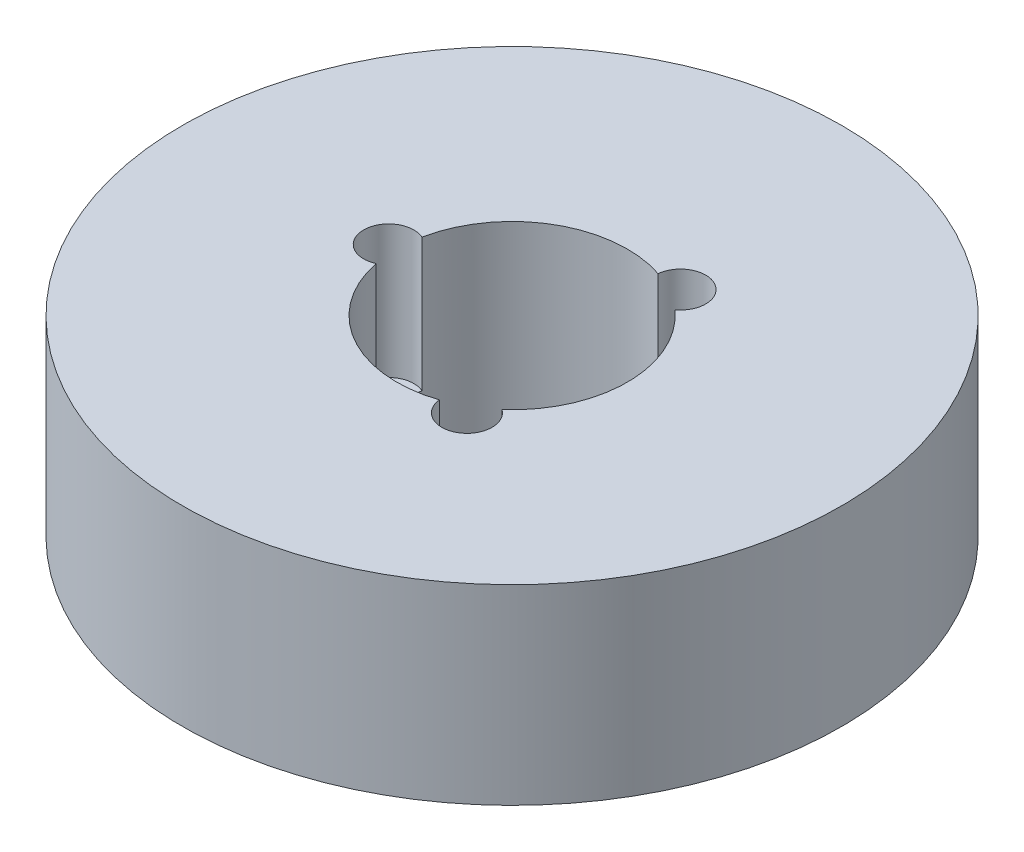
ISO-10303-21;
HEADER;
FILE_DESCRIPTION(('STEP AP214'),'2;1');
FILE_NAME('part.step','',(''),(''),'','','');
FILE_SCHEMA(('AUTOMOTIVE_DESIGN { 1 0 10303 214 1 1 1 1 }'));
ENDSEC;
DATA;
#1=APPLICATION_CONTEXT('core data for automotive mechanical design processes');
#2=APPLICATION_PROTOCOL_DEFINITION('international standard','automotive_design',2000,#1);
#3=PRODUCT_CONTEXT('',#1,'mechanical');
#4=PRODUCT('Part','Part','',(#3));
#5=PRODUCT_RELATED_PRODUCT_CATEGORY('part','',(#4));
#6=PRODUCT_DEFINITION_FORMATION('','',#4);
#7=PRODUCT_DEFINITION_CONTEXT('part definition',#1,'design');
#8=PRODUCT_DEFINITION('design','',#6,#7);
#9=PRODUCT_DEFINITION_SHAPE('','',#8);
#10=(LENGTH_UNIT() NAMED_UNIT(*) SI_UNIT(.MILLI.,.METRE.));
#11=(NAMED_UNIT(*) PLANE_ANGLE_UNIT() SI_UNIT($,.RADIAN.));
#12=(NAMED_UNIT(*) SI_UNIT($,.STERADIAN.) SOLID_ANGLE_UNIT());
#13=UNCERTAINTY_MEASURE_WITH_UNIT(LENGTH_MEASURE(1.E-05),#10,'distance_accuracy_value','');
#14=(GEOMETRIC_REPRESENTATION_CONTEXT(3) GLOBAL_UNCERTAINTY_ASSIGNED_CONTEXT((#13)) GLOBAL_UNIT_ASSIGNED_CONTEXT((#10,
#11,#12)) REPRESENTATION_CONTEXT('',''));
#15=CARTESIAN_POINT('',(0.,0.,0.));
#16=DIRECTION('',(0.,0.,1.));
#17=DIRECTION('',(1.,0.,0.));
#18=AXIS2_PLACEMENT_3D('',#15,#16,#17);
#19=CARTESIAN_POINT('',(0.,29.,0.));
#20=DIRECTION('',(0.,-1.,0.));
#21=DIRECTION('',(0.,0.,-1.));
#22=AXIS2_PLACEMENT_3D('',#19,#20,#21);
#23=CYLINDRICAL_SURFACE('',#22,50.);
#24=CARTESIAN_POINT('',(0.,29.,0.));
#25=DIRECTION('',(0.,1.,0.));
#26=DIRECTION('',(0.,0.,1.));
#27=AXIS2_PLACEMENT_3D('',#24,#25,#26);
#28=CIRCLE('',#27,50.);
#29=CARTESIAN_POINT('',(0.,29.,-50.));
#30=VERTEX_POINT('',#29);
#31=EDGE_CURVE('E126',#30,#30,#28,.T.);
#32=CARTESIAN_POINT('',(0.,0.,0.));
#33=DIRECTION('',(0.,1.,0.));
#34=DIRECTION('',(0.,0.,1.));
#35=AXIS2_PLACEMENT_3D('',#32,#33,#34);
#36=CIRCLE('',#35,50.);
#37=CARTESIAN_POINT('',(0.,0.,-50.));
#38=VERTEX_POINT('',#37);
#39=EDGE_CURVE('E124',#38,#38,#36,.T.);
#40=CARTESIAN_POINT('',(0.,29.,-50.));
#41=CARTESIAN_POINT('',(0.,28.6979166666667,-50.));
#42=CARTESIAN_POINT('',(0.,28.3958333333333,-50.));
#43=CARTESIAN_POINT('',(0.,27.7916666666667,-50.));
#44=CARTESIAN_POINT('',(0.,27.4895833333333,-50.));
#45=CARTESIAN_POINT('',(0.,26.8854166666667,-50.));
#46=CARTESIAN_POINT('',(0.,26.5833333333333,-50.));
#47=CARTESIAN_POINT('',(0.,25.9791666666667,-50.));
#48=CARTESIAN_POINT('',(0.,25.6770833333333,-50.));
#49=CARTESIAN_POINT('',(0.,25.0729166666667,-50.));
#50=CARTESIAN_POINT('',(0.,24.7708333333333,-50.));
#51=CARTESIAN_POINT('',(0.,24.1666666666667,-50.));
#52=CARTESIAN_POINT('',(0.,23.8645833333333,-50.));
#53=CARTESIAN_POINT('',(0.,23.2604166666667,-50.));
#54=CARTESIAN_POINT('',(0.,22.9583333333333,-50.));
#55=CARTESIAN_POINT('',(0.,22.3541666666667,-50.));
#56=CARTESIAN_POINT('',(0.,22.0520833333333,-50.));
#57=CARTESIAN_POINT('',(0.,21.4479166666667,-50.));
#58=CARTESIAN_POINT('',(0.,21.1458333333333,-50.));
#59=CARTESIAN_POINT('',(0.,20.5416666666667,-50.));
#60=CARTESIAN_POINT('',(0.,20.2395833333333,-50.));
#61=CARTESIAN_POINT('',(0.,19.6354166666667,-50.));
#62=CARTESIAN_POINT('',(0.,19.3333333333333,-50.));
#63=CARTESIAN_POINT('',(0.,18.7291666666667,-50.));
#64=CARTESIAN_POINT('',(0.,18.4270833333333,-50.));
#65=CARTESIAN_POINT('',(0.,17.8229166666667,-50.));
#66=CARTESIAN_POINT('',(0.,17.5208333333333,-50.));
#67=CARTESIAN_POINT('',(0.,16.9166666666667,-50.));
#68=CARTESIAN_POINT('',(0.,16.6145833333333,-50.));
#69=CARTESIAN_POINT('',(0.,16.0104166666667,-50.));
#70=CARTESIAN_POINT('',(0.,15.7083333333333,-50.));
#71=CARTESIAN_POINT('',(0.,15.1041666666667,-50.));
#72=CARTESIAN_POINT('',(0.,14.8020833333333,-50.));
#73=CARTESIAN_POINT('',(0.,14.1979166666667,-50.));
#74=CARTESIAN_POINT('',(0.,13.8958333333333,-50.));
#75=CARTESIAN_POINT('',(0.,13.2916666666667,-50.));
#76=CARTESIAN_POINT('',(0.,12.9895833333333,-50.));
#77=CARTESIAN_POINT('',(0.,12.3854166666667,-50.));
#78=CARTESIAN_POINT('',(0.,12.0833333333333,-50.));
#79=CARTESIAN_POINT('',(0.,11.4791666666667,-50.));
#80=CARTESIAN_POINT('',(0.,11.1770833333333,-50.));
#81=CARTESIAN_POINT('',(0.,10.5729166666667,-50.));
#82=CARTESIAN_POINT('',(0.,10.2708333333333,-50.));
#83=CARTESIAN_POINT('',(0.,9.66666666666667,-50.));
#84=CARTESIAN_POINT('',(0.,9.36458333333333,-50.));
#85=CARTESIAN_POINT('',(0.,8.76041666666667,-50.));
#86=CARTESIAN_POINT('',(0.,8.45833333333333,-50.));
#87=CARTESIAN_POINT('',(0.,7.85416666666667,-50.));
#88=CARTESIAN_POINT('',(0.,7.55208333333333,-50.));
#89=CARTESIAN_POINT('',(0.,6.94791666666667,-50.));
#90=CARTESIAN_POINT('',(0.,6.64583333333333,-50.));
#91=CARTESIAN_POINT('',(0.,6.04166666666667,-50.));
#92=CARTESIAN_POINT('',(0.,5.73958333333333,-50.));
#93=CARTESIAN_POINT('',(0.,5.13541666666667,-50.));
#94=CARTESIAN_POINT('',(0.,4.83333333333333,-50.));
#95=CARTESIAN_POINT('',(0.,4.22916666666667,-50.));
#96=CARTESIAN_POINT('',(0.,3.92708333333333,-50.));
#97=CARTESIAN_POINT('',(0.,3.32291666666667,-50.));
#98=CARTESIAN_POINT('',(0.,3.02083333333333,-50.));
#99=CARTESIAN_POINT('',(0.,2.41666666666667,-50.));
#100=CARTESIAN_POINT('',(0.,2.11458333333333,-50.));
#101=CARTESIAN_POINT('',(0.,1.51041666666667,-50.));
#102=CARTESIAN_POINT('',(0.,1.20833333333333,-50.));
#103=CARTESIAN_POINT('',(0.,0.604166666666667,-50.));
#104=CARTESIAN_POINT('',(0.,0.302083333333333,-50.));
#105=CARTESIAN_POINT('',(0.,0.,-50.));
#106=B_SPLINE_CURVE_WITH_KNOTS('',3,(#40,#41,#42,#43,#44,#45,#46,#47,#48,#49,#50,#51,#52,#53,
#54,#55,#56,#57,#58,#59,#60,#61,#62,#63,#64,#65,#66,#67,#68,#69,#70,#71,#72,#73,#74,#75,#76,#77,
#78,#79,#80,#81,#82,#83,#84,#85,#86,#87,#88,#89,#90,#91,#92,#93,#94,#95,#96,#97,#98,#99,#100,
#101,#102,#103,#104,#105),.UNSPECIFIED.,.F.,.F.,(4,2,2,2,2,2,2,2,2,2,2,2,2,2,2,2,2,2,2,2,2,2,2,
2,2,2,2,2,2,2,2,2,4),(0.,0.906250000000001,1.8125,2.71875,3.625,4.53125,5.4375,6.34375,7.25,
8.15625,9.0625,9.96875,10.875,11.78125,12.6875,13.59375,14.5,15.40625,16.3125,17.21875,18.125,
19.03125,19.9375,20.84375,21.75,22.65625,23.5625,24.46875,25.375,26.28125,27.1875,28.09375,29.),.UNSPECIFIED.);
#107=EDGE_CURVE('BSEAM39',#30,#38,#106,.T.);
#108=ORIENTED_EDGE('',*,*,#31,.F.);
#109=ORIENTED_EDGE('',*,*,#39,.T.);
#110=ORIENTED_EDGE('',*,*,#107,.T.);
#111=ORIENTED_EDGE('',*,*,#107,.F.);
#112=EDGE_LOOP('',(#108,#110,#109,#111));
#113=FACE_BOUND('',#112,.T.);
#114=ADVANCED_FACE('F39',(#113),#23,.T.);
#115=CARTESIAN_POINT('',(0.,29.,0.));
#116=DIRECTION('',(0.,1.,0.));
#117=DIRECTION('',(0.,0.,1.));
#118=AXIS2_PLACEMENT_3D('',#115,#116,#117);
#119=PLANE('',#118);
#120=CARTESIAN_POINT('',(9.35569236308464,29.,16.2045345128466));
#121=DIRECTION('',(0.,1.,0.));
#122=DIRECTION('',(0.866025403784436,0.,-0.500000000000004));
#123=AXIS2_PLACEMENT_3D('',#120,#121,#122);
#124=CIRCLE('',#123,3.81204136220091);
#125=CARTESIAN_POINT('',(5.56340607662919,29.,16.5921220109583));
#126=VERTEX_POINT('',#125);
#127=CARTESIAN_POINT('',(11.5874961258663,29.,13.1141119994086));
#128=VERTEX_POINT('',#127);
#129=EDGE_CURVE('E147',#126,#128,#124,.T.);
#130=ORIENTED_EDGE('',*,*,#129,.F.);
#131=CARTESIAN_POINT('',(0.,29.,0.));
#132=DIRECTION('',(0.,1.,0.));
#133=DIRECTION('',(0.,0.,1.));
#134=AXIS2_PLACEMENT_3D('',#131,#132,#133);
#135=CIRCLE('',#134,17.5);
#136=CARTESIAN_POINT('',(-17.1509022024954,29.,3.47801001154962));
#137=VERTEX_POINT('',#136);
#138=EDGE_CURVE('E118',#137,#126,#135,.T.);
#139=ORIENTED_EDGE('',*,*,#138,.F.);
#140=CARTESIAN_POINT('',(-18.7113847261691,29.,0.));
#141=DIRECTION('',(0.,1.,0.));
#142=DIRECTION('',(0.,0.,1.));
#143=AXIS2_PLACEMENT_3D('',#140,#141,#142);
#144=CIRCLE('',#143,3.81204136220091);
#145=CARTESIAN_POINT('',(-17.1509022024954,29.,-3.47801001154962));
#146=VERTEX_POINT('',#145);
#147=EDGE_CURVE('E113',#146,#137,#144,.T.);
#148=ORIENTED_EDGE('',*,*,#147,.F.);
#149=CARTESIAN_POINT('',(5.56340607662896,29.,-16.5921220109583));
#150=VERTEX_POINT('',#149);
#151=EDGE_CURVE('E106',#150,#146,#135,.T.);
#152=ORIENTED_EDGE('',*,*,#151,.F.);
#153=CARTESIAN_POINT('',(9.35569236308441,29.,-16.2045345128467));
#154=DIRECTION('',(0.,1.,0.));
#155=DIRECTION('',(-0.866025403784443,0.,-0.499999999999992));
#156=AXIS2_PLACEMENT_3D('',#153,#154,#155);
#157=CIRCLE('',#156,3.81204136220091);
#158=CARTESIAN_POINT('',(11.5874961258661,29.,-13.1141119994088));
#159=VERTEX_POINT('',#158);
#160=EDGE_CURVE('E90',#159,#150,#157,.T.);
#161=ORIENTED_EDGE('',*,*,#160,.F.);
#162=EDGE_CURVE('E116',#128,#159,#135,.T.);
#163=ORIENTED_EDGE('',*,*,#162,.F.);
#164=EDGE_LOOP('',(#130,#139,#148,#152,#161,#163));
#165=FACE_BOUND('',#164,.T.);
#166=ORIENTED_EDGE('',*,*,#31,.T.);
#167=EDGE_LOOP('',(#166));
#168=FACE_BOUND('',#167,.T.);
#169=ADVANCED_FACE('F115',(#165,#168),#119,.T.);
#170=CARTESIAN_POINT('',(0.,0.,0.));
#171=DIRECTION('',(0.,1.,0.));
#172=DIRECTION('',(0.,0.,1.));
#173=AXIS2_PLACEMENT_3D('',#170,#171,#172);
#174=PLANE('',#173);
#175=CARTESIAN_POINT('',(0.,0.,0.));
#176=DIRECTION('',(0.,1.,0.));
#177=DIRECTION('',(0.,0.,1.));
#178=AXIS2_PLACEMENT_3D('',#175,#176,#177);
#179=CIRCLE('',#178,17.5);
#180=CARTESIAN_POINT('',(0.,0.,17.5));
#181=VERTEX_POINT('',#180);
#182=EDGE_CURVE('E120',#181,#181,#179,.T.);
#183=ORIENTED_EDGE('',*,*,#182,.T.);
#184=EDGE_LOOP('',(#183));
#185=FACE_BOUND('',#184,.T.);
#186=ORIENTED_EDGE('',*,*,#39,.F.);
#187=EDGE_LOOP('',(#186));
#188=FACE_BOUND('',#187,.T.);
#189=ADVANCED_FACE('F164',(#185,#188),#174,.F.);
#190=CARTESIAN_POINT('',(0.,29.,0.));
#191=DIRECTION('',(0.,-1.,0.));
#192=DIRECTION('',(0.,0.,-1.));
#193=AXIS2_PLACEMENT_3D('',#190,#191,#192);
#194=CYLINDRICAL_SURFACE('',#193,17.5);
#195=DIRECTION('',(0.,1.,0.));
#196=VECTOR('',#195,1.);
#197=CARTESIAN_POINT('',(5.56340607662919,18.9057479343199,16.5921220109583));
#198=LINE('',#197,#196);
#199=CARTESIAN_POINT('',(5.56340607662919,8.81149586863979,16.5921220109583));
#200=VERTEX_POINT('',#199);
#201=EDGE_CURVE('E11',#200,#126,#198,.T.);
#202=ORIENTED_EDGE('',*,*,#201,.F.);
#203=CARTESIAN_POINT('',(0.,8.81149586863979,0.));
#204=DIRECTION('',(0.,1.,0.));
#205=DIRECTION('',(0.,0.,1.));
#206=AXIS2_PLACEMENT_3D('',#203,#204,#205);
#207=CIRCLE('',#206,17.5);
#208=CARTESIAN_POINT('',(11.5874961258663,8.81149586863979,13.1141119994086));
#209=VERTEX_POINT('',#208);
#210=EDGE_CURVE('E144',#200,#209,#207,.T.);
#211=ORIENTED_EDGE('',*,*,#210,.T.);
#212=DIRECTION('',(0.,1.,0.));
#213=VECTOR('',#212,1.);
#214=CARTESIAN_POINT('',(11.5874961258663,18.9057479343199,13.1141119994086));
#215=LINE('',#214,#213);
#216=EDGE_CURVE('E46',#128,#209,#215,.F.);
#217=ORIENTED_EDGE('',*,*,#216,.F.);
#218=ORIENTED_EDGE('',*,*,#162,.T.);
#219=DIRECTION('',(0.,1.,0.));
#220=VECTOR('',#219,1.);
#221=CARTESIAN_POINT('',(11.5874961258661,18.9057479343199,-13.1141119994088));
#222=LINE('',#221,#220);
#223=CARTESIAN_POINT('',(11.5874961258661,8.81149586863979,-13.1141119994088));
#224=VERTEX_POINT('',#223);
#225=EDGE_CURVE('E92',#224,#159,#222,.T.);
#226=ORIENTED_EDGE('',*,*,#225,.F.);
#227=CARTESIAN_POINT('',(0.,8.81149586863979,0.));
#228=DIRECTION('',(0.,1.,0.));
#229=DIRECTION('',(0.,0.,1.));
#230=AXIS2_PLACEMENT_3D('',#227,#228,#229);
#231=CIRCLE('',#230,17.5);
#232=CARTESIAN_POINT('',(5.56340607662896,8.81149586863979,-16.5921220109583));
#233=VERTEX_POINT('',#232);
#234=EDGE_CURVE('E107',#224,#233,#231,.T.);
#235=ORIENTED_EDGE('',*,*,#234,.T.);
#236=DIRECTION('',(0.,1.,0.));
#237=VECTOR('',#236,1.);
#238=CARTESIAN_POINT('',(5.56340607662896,18.9057479343199,-16.5921220109583));
#239=LINE('',#238,#237);
#240=EDGE_CURVE('E95',#150,#233,#239,.F.);
#241=ORIENTED_EDGE('',*,*,#240,.F.);
#242=ORIENTED_EDGE('',*,*,#151,.T.);
#243=DIRECTION('',(0.,1.,0.));
#244=VECTOR('',#243,1.);
#245=CARTESIAN_POINT('',(-17.1509022024954,18.9057479343199,-3.47801001154962));
#246=LINE('',#245,#244);
#247=CARTESIAN_POINT('',(-17.1509022024954,8.81149586863979,-3.47801001154962));
#248=VERTEX_POINT('',#247);
#249=EDGE_CURVE('E143',#248,#146,#246,.T.);
#250=ORIENTED_EDGE('',*,*,#249,.F.);
#251=CARTESIAN_POINT('',(0.,8.81149586863979,0.));
#252=DIRECTION('',(0.,1.,0.));
#253=DIRECTION('',(0.,0.,1.));
#254=AXIS2_PLACEMENT_3D('',#251,#252,#253);
#255=CIRCLE('',#254,17.5);
#256=CARTESIAN_POINT('',(-17.1509022024954,8.81149586863979,3.47801001154962));
#257=VERTEX_POINT('',#256);
#258=EDGE_CURVE('E132',#248,#257,#255,.T.);
#259=ORIENTED_EDGE('',*,*,#258,.T.);
#260=DIRECTION('',(0.,1.,0.));
#261=VECTOR('',#260,1.);
#262=CARTESIAN_POINT('',(-17.1509022024954,18.9057479343199,3.47801001154962));
#263=LINE('',#262,#261);
#264=EDGE_CURVE('E137',#137,#257,#263,.F.);
#265=ORIENTED_EDGE('',*,*,#264,.F.);
#266=ORIENTED_EDGE('',*,*,#138,.T.);
#267=EDGE_LOOP('',(#202,#211,#217,#218,#226,#235,#241,#242,#250,#259,#265,#266));
#268=FACE_BOUND('',#267,.T.);
#269=ORIENTED_EDGE('',*,*,#182,.F.);
#270=EDGE_LOOP('',(#269));
#271=FACE_BOUND('',#270,.T.);
#272=ADVANCED_FACE('F103',(#268,#271),#194,.F.);
#273=CARTESIAN_POINT('',(-18.7113847261691,8.81149586863979,0.));
#274=DIRECTION('',(0.,1.,0.));
#275=DIRECTION('',(0.,0.,1.));
#276=AXIS2_PLACEMENT_3D('',#273,#274,#275);
#277=CYLINDRICAL_SURFACE('',#276,3.81204136220091);
#278=ORIENTED_EDGE('',*,*,#249,.T.);
#279=ORIENTED_EDGE('',*,*,#147,.T.);
#280=ORIENTED_EDGE('',*,*,#264,.T.);
#281=CARTESIAN_POINT('',(-18.7113847261691,8.81149586863979,0.));
#282=DIRECTION('',(0.,1.,0.));
#283=DIRECTION('',(0.,0.,1.));
#284=AXIS2_PLACEMENT_3D('',#281,#282,#283);
#285=CIRCLE('',#284,3.81204136220091);
#286=EDGE_CURVE('E121',#248,#257,#285,.T.);
#287=ORIENTED_EDGE('',*,*,#286,.F.);
#288=EDGE_LOOP('',(#278,#279,#280,#287));
#289=FACE_BOUND('',#288,.T.);
#290=ADVANCED_FACE('F174',(#289),#277,.F.);
#291=CARTESIAN_POINT('',(-18.7113847261691,8.81149586863979,0.));
#292=DIRECTION('',(0.,1.,0.));
#293=DIRECTION('',(0.,0.,1.));
#294=AXIS2_PLACEMENT_3D('',#291,#292,#293);
#295=PLANE('',#294);
#296=ORIENTED_EDGE('',*,*,#286,.T.);
#297=ORIENTED_EDGE('',*,*,#258,.F.);
#298=EDGE_LOOP('',(#296,#297));
#299=FACE_BOUND('',#298,.T.);
#300=ADVANCED_FACE('F177',(#299),#295,.T.);
#301=CARTESIAN_POINT('',(9.35569236308441,8.81149586863979,-16.2045345128467));
#302=DIRECTION('',(0.,1.,0.));
#303=DIRECTION('',(0.,0.,1.));
#304=AXIS2_PLACEMENT_3D('',#301,#302,#303);
#305=CYLINDRICAL_SURFACE('',#304,3.81204136220091);
#306=ORIENTED_EDGE('',*,*,#225,.T.);
#307=ORIENTED_EDGE('',*,*,#160,.T.);
#308=ORIENTED_EDGE('',*,*,#240,.T.);
#309=CARTESIAN_POINT('',(9.35569236308441,8.81149586863979,-16.2045345128467));
#310=DIRECTION('',(0.,1.,0.));
#311=DIRECTION('',(-0.866025403784443,0.,-0.499999999999992));
#312=AXIS2_PLACEMENT_3D('',#309,#310,#311);
#313=CIRCLE('',#312,3.81204136220091);
#314=EDGE_CURVE('E56',#224,#233,#313,.T.);
#315=ORIENTED_EDGE('',*,*,#314,.F.);
#316=EDGE_LOOP('',(#306,#307,#308,#315));
#317=FACE_BOUND('',#316,.T.);
#318=ADVANCED_FACE('F93',(#317),#305,.F.);
#319=CARTESIAN_POINT('',(9.35569236308441,8.81149586863979,-16.2045345128467));
#320=DIRECTION('',(0.,1.,0.));
#321=DIRECTION('',(-0.866025403784443,0.,-0.499999999999992));
#322=AXIS2_PLACEMENT_3D('',#319,#320,#321);
#323=PLANE('',#322);
#324=ORIENTED_EDGE('',*,*,#314,.T.);
#325=ORIENTED_EDGE('',*,*,#234,.F.);
#326=EDGE_LOOP('',(#324,#325));
#327=FACE_BOUND('',#326,.T.);
#328=ADVANCED_FACE('F160',(#327),#323,.T.);
#329=CARTESIAN_POINT('',(9.35569236308464,8.81149586863979,16.2045345128466));
#330=DIRECTION('',(0.,1.,0.));
#331=DIRECTION('',(0.,0.,1.));
#332=AXIS2_PLACEMENT_3D('',#329,#330,#331);
#333=CYLINDRICAL_SURFACE('',#332,3.81204136220091);
#334=ORIENTED_EDGE('',*,*,#201,.T.);
#335=ORIENTED_EDGE('',*,*,#129,.T.);
#336=ORIENTED_EDGE('',*,*,#216,.T.);
#337=CARTESIAN_POINT('',(9.35569236308464,8.81149586863979,16.2045345128466));
#338=DIRECTION('',(0.,1.,0.));
#339=DIRECTION('',(0.866025403784436,0.,-0.500000000000004));
#340=AXIS2_PLACEMENT_3D('',#337,#338,#339);
#341=CIRCLE('',#340,3.81204136220091);
#342=EDGE_CURVE('E55',#200,#209,#341,.T.);
#343=ORIENTED_EDGE('',*,*,#342,.F.);
#344=EDGE_LOOP('',(#334,#335,#336,#343));
#345=FACE_BOUND('',#344,.T.);
#346=ADVANCED_FACE('F149',(#345),#333,.F.);
#347=CARTESIAN_POINT('',(9.35569236308464,8.81149586863979,16.2045345128466));
#348=DIRECTION('',(0.,1.,0.));
#349=DIRECTION('',(0.866025403784436,0.,-0.500000000000004));
#350=AXIS2_PLACEMENT_3D('',#347,#348,#349);
#351=PLANE('',#350);
#352=ORIENTED_EDGE('',*,*,#342,.T.);
#353=ORIENTED_EDGE('',*,*,#210,.F.);
#354=EDGE_LOOP('',(#352,#353));
#355=FACE_BOUND('',#354,.T.);
#356=ADVANCED_FACE('F151',(#355),#351,.T.);
#357=CLOSED_SHELL('',(#114,#169,#189,#272,#290,#300,#318,#328,#346,#356));
#358=MANIFOLD_SOLID_BREP('B2',#357);
#359=ADVANCED_BREP_SHAPE_REPRESENTATION('',(#18,#358),#14);
#360=SHAPE_DEFINITION_REPRESENTATION(#9,#359);
ENDSEC;
END-ISO-10303-21;
